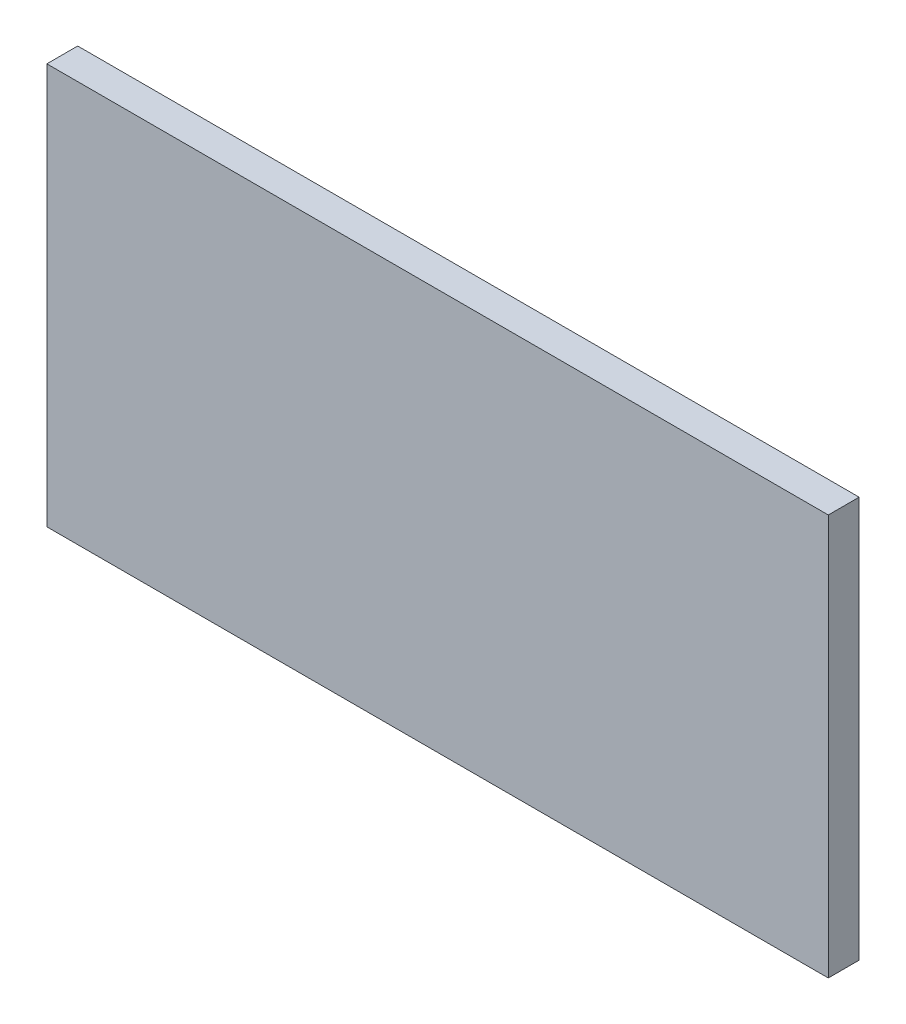
ISO-10303-21;
HEADER;
FILE_DESCRIPTION(('STEP AP214'),'2;1');
FILE_NAME('part.step','',(''),(''),'','','');
FILE_SCHEMA(('AUTOMOTIVE_DESIGN { 1 0 10303 214 1 1 1 1 }'));
ENDSEC;
DATA;
#1=APPLICATION_CONTEXT('core data for automotive mechanical design processes');
#2=APPLICATION_PROTOCOL_DEFINITION('international standard','automotive_design',2000,#1);
#3=PRODUCT_CONTEXT('',#1,'mechanical');
#4=PRODUCT('Part','Part','',(#3));
#5=PRODUCT_RELATED_PRODUCT_CATEGORY('part','',(#4));
#6=PRODUCT_DEFINITION_FORMATION('','',#4);
#7=PRODUCT_DEFINITION_CONTEXT('part definition',#1,'design');
#8=PRODUCT_DEFINITION('design','',#6,#7);
#9=PRODUCT_DEFINITION_SHAPE('','',#8);
#10=(LENGTH_UNIT() NAMED_UNIT(*) SI_UNIT(.MILLI.,.METRE.));
#11=(NAMED_UNIT(*) PLANE_ANGLE_UNIT() SI_UNIT($,.RADIAN.));
#12=(NAMED_UNIT(*) SI_UNIT($,.STERADIAN.) SOLID_ANGLE_UNIT());
#13=UNCERTAINTY_MEASURE_WITH_UNIT(LENGTH_MEASURE(1.E-05),#10,'distance_accuracy_value','');
#14=(GEOMETRIC_REPRESENTATION_CONTEXT(3) GLOBAL_UNCERTAINTY_ASSIGNED_CONTEXT((#13)) GLOBAL_UNIT_ASSIGNED_CONTEXT((#10,
#11,#12)) REPRESENTATION_CONTEXT('',''));
#15=CARTESIAN_POINT('',(0.,0.,0.));
#16=DIRECTION('',(0.,0.,1.));
#17=DIRECTION('',(1.,0.,0.));
#18=AXIS2_PLACEMENT_3D('',#15,#16,#17);
#19=CARTESIAN_POINT('',(0.,0.,3.));
#20=DIRECTION('',(1.,0.,0.));
#21=DIRECTION('',(0.,0.,-1.));
#22=AXIS2_PLACEMENT_3D('',#19,#20,#21);
#23=PLANE('',#22);
#24=DIRECTION('',(0.,-1.,0.));
#25=VECTOR('',#24,1.);
#26=CARTESIAN_POINT('',(0.,0.,0.));
#27=LINE('',#26,#25);
#28=CARTESIAN_POINT('',(0.,39.,0.));
#29=VERTEX_POINT('',#28);
#30=CARTESIAN_POINT('',(0.,0.,0.));
#31=VERTEX_POINT('',#30);
#32=EDGE_CURVE('E96',#29,#31,#27,.T.);
#33=ORIENTED_EDGE('',*,*,#32,.T.);
#34=DIRECTION('',(0.,0.,-1.));
#35=VECTOR('',#34,1.);
#36=CARTESIAN_POINT('',(0.,0.,3.));
#37=LINE('',#36,#35);
#38=CARTESIAN_POINT('',(0.,0.,3.));
#39=VERTEX_POINT('',#38);
#40=EDGE_CURVE('E11',#39,#31,#37,.T.);
#41=ORIENTED_EDGE('',*,*,#40,.F.);
#42=DIRECTION('',(0.,-1.,0.));
#43=VECTOR('',#42,1.);
#44=CARTESIAN_POINT('',(0.,0.,3.));
#45=LINE('',#44,#43);
#46=CARTESIAN_POINT('',(0.,39.,3.));
#47=VERTEX_POINT('',#46);
#48=EDGE_CURVE('E84',#47,#39,#45,.T.);
#49=ORIENTED_EDGE('',*,*,#48,.F.);
#50=DIRECTION('',(0.,0.,-1.));
#51=VECTOR('',#50,1.);
#52=CARTESIAN_POINT('',(0.,39.,3.));
#53=LINE('',#52,#51);
#54=EDGE_CURVE('E92',#47,#29,#53,.T.);
#55=ORIENTED_EDGE('',*,*,#54,.T.);
#56=EDGE_LOOP('',(#33,#41,#49,#55));
#57=FACE_BOUND('',#56,.T.);
#58=ADVANCED_FACE('F33',(#57),#23,.F.);
#59=CARTESIAN_POINT('',(0.,0.,3.));
#60=DIRECTION('',(0.,1.,0.));
#61=DIRECTION('',(0.,0.,1.));
#62=AXIS2_PLACEMENT_3D('',#59,#60,#61);
#63=PLANE('',#62);
#64=DIRECTION('',(1.,0.,0.));
#65=VECTOR('',#64,1.);
#66=CARTESIAN_POINT('',(0.,0.,0.));
#67=LINE('',#66,#65);
#68=CARTESIAN_POINT('',(76.,0.,0.));
#69=VERTEX_POINT('',#68);
#70=EDGE_CURVE('E88',#31,#69,#67,.T.);
#71=ORIENTED_EDGE('',*,*,#70,.T.);
#72=DIRECTION('',(0.,0.,-1.));
#73=VECTOR('',#72,1.);
#74=CARTESIAN_POINT('',(76.,0.,3.));
#75=LINE('',#74,#73);
#76=CARTESIAN_POINT('',(76.,0.,3.));
#77=VERTEX_POINT('',#76);
#78=EDGE_CURVE('E41',#77,#69,#75,.T.);
#79=ORIENTED_EDGE('',*,*,#78,.F.);
#80=DIRECTION('',(1.,0.,0.));
#81=VECTOR('',#80,1.);
#82=CARTESIAN_POINT('',(0.,0.,3.));
#83=LINE('',#82,#81);
#84=EDGE_CURVE('E79',#39,#77,#83,.T.);
#85=ORIENTED_EDGE('',*,*,#84,.F.);
#86=ORIENTED_EDGE('',*,*,#40,.T.);
#87=EDGE_LOOP('',(#71,#79,#85,#86));
#88=FACE_BOUND('',#87,.T.);
#89=ADVANCED_FACE('F87',(#88),#63,.F.);
#90=CARTESIAN_POINT('',(76.,0.,3.));
#91=DIRECTION('',(-1.,0.,0.));
#92=DIRECTION('',(0.,0.,1.));
#93=AXIS2_PLACEMENT_3D('',#90,#91,#92);
#94=PLANE('',#93);
#95=DIRECTION('',(0.,1.,0.));
#96=VECTOR('',#95,1.);
#97=CARTESIAN_POINT('',(76.,0.,0.));
#98=LINE('',#97,#96);
#99=CARTESIAN_POINT('',(76.,39.,0.));
#100=VERTEX_POINT('',#99);
#101=EDGE_CURVE('E66',#69,#100,#98,.T.);
#102=ORIENTED_EDGE('',*,*,#101,.T.);
#103=DIRECTION('',(0.,0.,-1.));
#104=VECTOR('',#103,1.);
#105=CARTESIAN_POINT('',(76.,39.,3.));
#106=LINE('',#105,#104);
#107=CARTESIAN_POINT('',(76.,39.,3.));
#108=VERTEX_POINT('',#107);
#109=EDGE_CURVE('E89',#108,#100,#106,.T.);
#110=ORIENTED_EDGE('',*,*,#109,.F.);
#111=DIRECTION('',(0.,1.,0.));
#112=VECTOR('',#111,1.);
#113=CARTESIAN_POINT('',(76.,0.,3.));
#114=LINE('',#113,#112);
#115=EDGE_CURVE('E82',#77,#108,#114,.T.);
#116=ORIENTED_EDGE('',*,*,#115,.F.);
#117=ORIENTED_EDGE('',*,*,#78,.T.);
#118=EDGE_LOOP('',(#102,#110,#116,#117));
#119=FACE_BOUND('',#118,.T.);
#120=ADVANCED_FACE('F90',(#119),#94,.F.);
#121=CARTESIAN_POINT('',(0.,39.,3.));
#122=DIRECTION('',(0.,-1.,0.));
#123=DIRECTION('',(0.,0.,-1.));
#124=AXIS2_PLACEMENT_3D('',#121,#122,#123);
#125=PLANE('',#124);
#126=DIRECTION('',(-1.,0.,0.));
#127=VECTOR('',#126,1.);
#128=CARTESIAN_POINT('',(0.,39.,0.));
#129=LINE('',#128,#127);
#130=EDGE_CURVE('E72',#100,#29,#129,.T.);
#131=ORIENTED_EDGE('',*,*,#130,.T.);
#132=ORIENTED_EDGE('',*,*,#54,.F.);
#133=DIRECTION('',(-1.,0.,0.));
#134=VECTOR('',#133,1.);
#135=CARTESIAN_POINT('',(0.,39.,3.));
#136=LINE('',#135,#134);
#137=EDGE_CURVE('E49',#108,#47,#136,.T.);
#138=ORIENTED_EDGE('',*,*,#137,.F.);
#139=ORIENTED_EDGE('',*,*,#109,.T.);
#140=EDGE_LOOP('',(#131,#132,#138,#139));
#141=FACE_BOUND('',#140,.T.);
#142=ADVANCED_FACE('F103',(#141),#125,.F.);
#143=CARTESIAN_POINT('',(0.,0.,3.));
#144=DIRECTION('',(0.,0.,-1.));
#145=DIRECTION('',(-1.,0.,0.));
#146=AXIS2_PLACEMENT_3D('',#143,#144,#145);
#147=PLANE('',#146);
#148=ORIENTED_EDGE('',*,*,#48,.T.);
#149=ORIENTED_EDGE('',*,*,#84,.T.);
#150=ORIENTED_EDGE('',*,*,#115,.T.);
#151=ORIENTED_EDGE('',*,*,#137,.T.);
#152=EDGE_LOOP('',(#148,#149,#150,#151));
#153=FACE_BOUND('',#152,.T.);
#154=ADVANCED_FACE('F80',(#153),#147,.F.);
#155=CARTESIAN_POINT('',(0.,0.,0.));
#156=DIRECTION('',(0.,0.,-1.));
#157=DIRECTION('',(-1.,0.,0.));
#158=AXIS2_PLACEMENT_3D('',#155,#156,#157);
#159=PLANE('',#158);
#160=ORIENTED_EDGE('',*,*,#32,.F.);
#161=ORIENTED_EDGE('',*,*,#130,.F.);
#162=ORIENTED_EDGE('',*,*,#101,.F.);
#163=ORIENTED_EDGE('',*,*,#70,.F.);
#164=EDGE_LOOP('',(#160,#161,#162,#163));
#165=FACE_BOUND('',#164,.T.);
#166=ADVANCED_FACE('F106',(#165),#159,.T.);
#167=CLOSED_SHELL('',(#58,#89,#120,#142,#154,#166));
#168=MANIFOLD_SOLID_BREP('B2',#167);
#169=ADVANCED_BREP_SHAPE_REPRESENTATION('',(#18,#168),#14);
#170=SHAPE_DEFINITION_REPRESENTATION(#9,#169);
ENDSEC;
END-ISO-10303-21;
